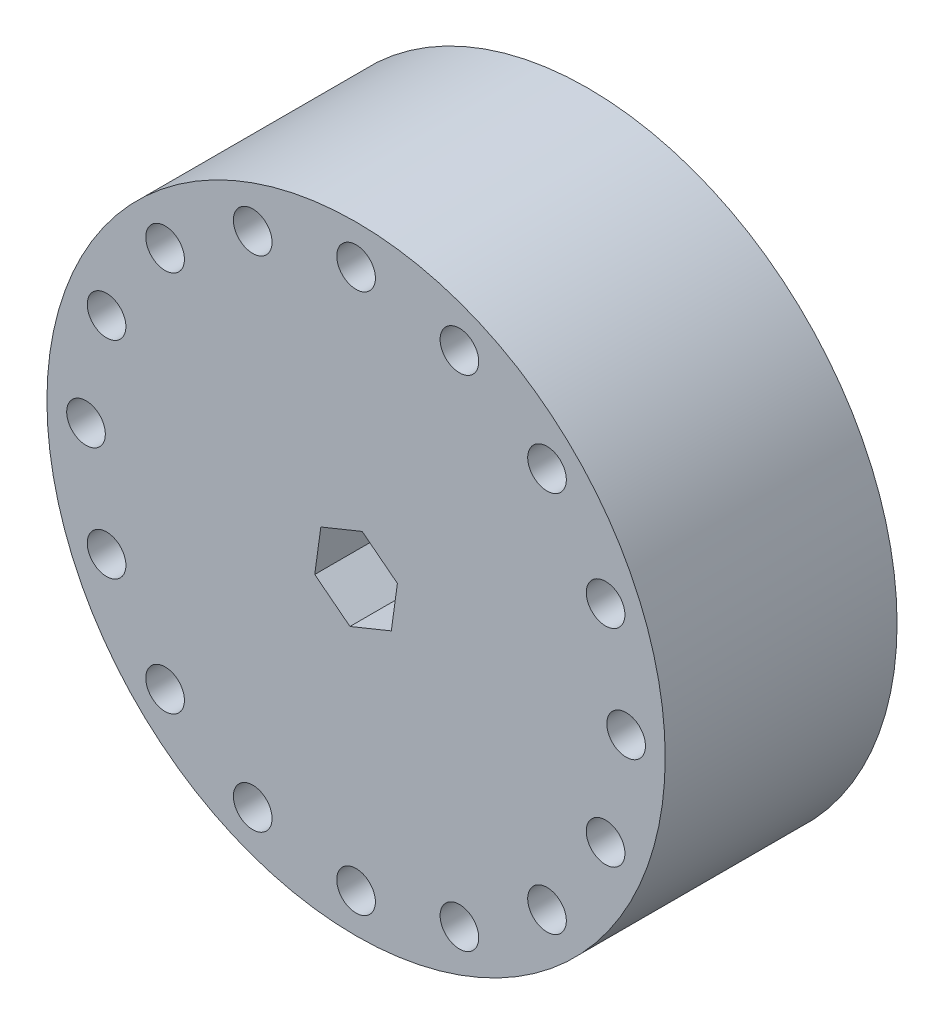
ISO-10303-21;
HEADER;
FILE_DESCRIPTION(('STEP AP214'),'2;1');
FILE_NAME('part.step','',(''),(''),'','','');
FILE_SCHEMA(('AUTOMOTIVE_DESIGN { 1 0 10303 214 1 1 1 1 }'));
ENDSEC;
DATA;
#1=APPLICATION_CONTEXT('core data for automotive mechanical design processes');
#2=APPLICATION_PROTOCOL_DEFINITION('international standard','automotive_design',2000,#1);
#3=PRODUCT_CONTEXT('',#1,'mechanical');
#4=PRODUCT('Part','Part','',(#3));
#5=PRODUCT_RELATED_PRODUCT_CATEGORY('part','',(#4));
#6=PRODUCT_DEFINITION_FORMATION('','',#4);
#7=PRODUCT_DEFINITION_CONTEXT('part definition',#1,'design');
#8=PRODUCT_DEFINITION('design','',#6,#7);
#9=PRODUCT_DEFINITION_SHAPE('','',#8);
#10=(LENGTH_UNIT() NAMED_UNIT(*) SI_UNIT(.MILLI.,.METRE.));
#11=(NAMED_UNIT(*) PLANE_ANGLE_UNIT() SI_UNIT($,.RADIAN.));
#12=(NAMED_UNIT(*) SI_UNIT($,.STERADIAN.) SOLID_ANGLE_UNIT());
#13=UNCERTAINTY_MEASURE_WITH_UNIT(LENGTH_MEASURE(1.E-05),#10,'distance_accuracy_value','');
#14=(GEOMETRIC_REPRESENTATION_CONTEXT(3) GLOBAL_UNCERTAINTY_ASSIGNED_CONTEXT((#13)) GLOBAL_UNIT_ASSIGNED_CONTEXT((#10,
#11,#12)) REPRESENTATION_CONTEXT('',''));
#15=CARTESIAN_POINT('',(0.,0.,0.));
#16=DIRECTION('',(0.,0.,1.));
#17=DIRECTION('',(1.,0.,0.));
#18=AXIS2_PLACEMENT_3D('',#15,#16,#17);
#19=CARTESIAN_POINT('',(0.,0.,38.1));
#20=DIRECTION('',(0.,0.,1.));
#21=DIRECTION('',(1.,0.,0.));
#22=AXIS2_PLACEMENT_3D('',#19,#20,#21);
#23=PLANE('',#22);
#24=CARTESIAN_POINT('',(-16.9823955575771,40.9991296766855,38.1));
#25=DIRECTION('',(0.,0.,1.));
#26=DIRECTION('',(1.,0.,0.));
#27=AXIS2_PLACEMENT_3D('',#24,#25,#26);
#28=CIRCLE('',#27,3.17500000000211);
#29=CARTESIAN_POINT('',(-13.807395557575,40.9991296766855,38.1));
#30=VERTEX_POINT('',#29);
#31=EDGE_CURVE('E380',#30,#30,#28,.T.);
#32=ORIENTED_EDGE('',*,*,#31,.F.);
#33=EDGE_LOOP('',(#32));
#34=FACE_BOUND('',#33,.T.);
#35=CARTESIAN_POINT('',(-31.3793753373108,31.3793753373074,38.1));
#36=DIRECTION('',(0.,0.,1.));
#37=DIRECTION('',(1.,0.,0.));
#38=AXIS2_PLACEMENT_3D('',#35,#36,#37);
#39=CIRCLE('',#38,3.17500000000451);
#40=CARTESIAN_POINT('',(-28.2043753373063,31.3793753373074,38.1));
#41=VERTEX_POINT('',#40);
#42=EDGE_CURVE('E382',#41,#41,#39,.T.);
#43=ORIENTED_EDGE('',*,*,#42,.F.);
#44=EDGE_LOOP('',(#43));
#45=FACE_BOUND('',#44,.T.);
#46=CARTESIAN_POINT('',(-40.9991296766835,16.9823955575701,38.1));
#47=DIRECTION('',(0.,0.,1.));
#48=DIRECTION('',(1.,0.,0.));
#49=AXIS2_PLACEMENT_3D('',#46,#47,#48);
#50=CIRCLE('',#49,3.1750000000075);
#51=CARTESIAN_POINT('',(-37.824129676676,16.9823955575701,38.1));
#52=VERTEX_POINT('',#51);
#53=EDGE_CURVE('E388',#52,#52,#50,.T.);
#54=ORIENTED_EDGE('',*,*,#53,.F.);
#55=EDGE_LOOP('',(#54));
#56=FACE_BOUND('',#55,.T.);
#57=CARTESIAN_POINT('',(-44.377138180816,-8.19828182373377E-12,38.1));
#58=DIRECTION('',(0.,0.,1.));
#59=DIRECTION('',(1.,0.,0.));
#60=AXIS2_PLACEMENT_3D('',#57,#58,#59);
#61=CIRCLE('',#60,3.17500000001068);
#62=CARTESIAN_POINT('',(-41.2021381808053,-8.19828182373377E-12,38.1));
#63=VERTEX_POINT('',#62);
#64=EDGE_CURVE('E394',#63,#63,#61,.T.);
#65=ORIENTED_EDGE('',*,*,#64,.F.);
#66=EDGE_LOOP('',(#65));
#67=FACE_BOUND('',#66,.T.);
#68=CARTESIAN_POINT('',(-40.9991296766773,-16.9823955575853,38.1));
#69=DIRECTION('',(0.,0.,1.));
#70=DIRECTION('',(1.,0.,0.));
#71=AXIS2_PLACEMENT_3D('',#68,#69,#70);
#72=CIRCLE('',#71,3.1750000000135);
#73=CARTESIAN_POINT('',(-37.8241296766638,-16.9823955575853,38.1));
#74=VERTEX_POINT('',#73);
#75=EDGE_CURVE('E400',#74,#74,#72,.T.);
#76=ORIENTED_EDGE('',*,*,#75,.F.);
#77=EDGE_LOOP('',(#76));
#78=FACE_BOUND('',#77,.T.);
#79=CARTESIAN_POINT('',(-31.3793753372992,-31.379375337319,38.1));
#80=DIRECTION('',(0.,0.,1.));
#81=DIRECTION('',(1.,0.,0.));
#82=AXIS2_PLACEMENT_3D('',#79,#80,#81);
#83=CIRCLE('',#82,3.17500000001545);
#84=CARTESIAN_POINT('',(-28.2043753372838,-31.379375337319,38.1));
#85=VERTEX_POINT('',#84);
#86=EDGE_CURVE('E406',#85,#85,#83,.T.);
#87=ORIENTED_EDGE('',*,*,#86,.F.);
#88=EDGE_LOOP('',(#87));
#89=FACE_BOUND('',#88,.T.);
#90=CARTESIAN_POINT('',(-16.9823955575619,-40.9991296766917,38.1));
#91=DIRECTION('',(0.,0.,1.));
#92=DIRECTION('',(1.,0.,0.));
#93=AXIS2_PLACEMENT_3D('',#90,#91,#92);
#94=CIRCLE('',#93,3.17500000001632);
#95=CARTESIAN_POINT('',(-13.8073955575456,-40.9991296766917,38.1));
#96=VERTEX_POINT('',#95);
#97=EDGE_CURVE('E412',#96,#96,#94,.T.);
#98=ORIENTED_EDGE('',*,*,#97,.F.);
#99=EDGE_LOOP('',(#98));
#100=FACE_BOUND('',#99,.T.);
#101=CARTESIAN_POINT('',(1.63856943834218E-11,-44.3771381808242,38.1));
#102=DIRECTION('',(0.,0.,1.));
#103=DIRECTION('',(1.,0.,0.));
#104=AXIS2_PLACEMENT_3D('',#101,#102,#103);
#105=CIRCLE('',#104,3.17500000001597);
#106=CARTESIAN_POINT('',(3.17500000003235,-44.3771381808242,38.1));
#107=VERTEX_POINT('',#106);
#108=EDGE_CURVE('E418',#107,#107,#105,.T.);
#109=ORIENTED_EDGE('',*,*,#108,.F.);
#110=EDGE_LOOP('',(#109));
#111=FACE_BOUND('',#110,.T.);
#112=CARTESIAN_POINT('',(16.9823955575934,-40.9991296766855,38.1));
#113=DIRECTION('',(0.,0.,1.));
#114=DIRECTION('',(1.,0.,0.));
#115=AXIS2_PLACEMENT_3D('',#112,#113,#114);
#116=CIRCLE('',#115,3.17500000001442);
#117=CARTESIAN_POINT('',(20.1573955576078,-40.9991296766855,38.1));
#118=VERTEX_POINT('',#117);
#119=EDGE_CURVE('E424',#118,#118,#116,.T.);
#120=ORIENTED_EDGE('',*,*,#119,.F.);
#121=EDGE_LOOP('',(#120));
#122=FACE_BOUND('',#121,.T.);
#123=CARTESIAN_POINT('',(31.3793753373272,-31.3793753373074,38.1));
#124=DIRECTION('',(0.,0.,1.));
#125=DIRECTION('',(1.,0.,0.));
#126=AXIS2_PLACEMENT_3D('',#123,#124,#125);
#127=CIRCLE('',#126,3.1750000000119);
#128=CARTESIAN_POINT('',(34.5543753373391,-31.3793753373074,38.1));
#129=VERTEX_POINT('',#128);
#130=EDGE_CURVE('E430',#129,#129,#127,.T.);
#131=ORIENTED_EDGE('',*,*,#130,.F.);
#132=EDGE_LOOP('',(#131));
#133=FACE_BOUND('',#132,.T.);
#134=CARTESIAN_POINT('',(40.9991296766999,-16.9823955575701,38.1));
#135=DIRECTION('',(0.,0.,1.));
#136=DIRECTION('',(1.,0.,0.));
#137=AXIS2_PLACEMENT_3D('',#134,#135,#136);
#138=CIRCLE('',#137,3.17500000000881);
#139=CARTESIAN_POINT('',(44.1741296767087,-16.9823955575701,38.1));
#140=VERTEX_POINT('',#139);
#141=EDGE_CURVE('E436',#140,#140,#138,.T.);
#142=ORIENTED_EDGE('',*,*,#141,.F.);
#143=EDGE_LOOP('',(#142));
#144=FACE_BOUND('',#143,.T.);
#145=CARTESIAN_POINT('',(44.3771381808323,8.19284719171092E-12,38.1));
#146=DIRECTION('',(0.,0.,1.));
#147=DIRECTION('',(1.,0.,0.));
#148=AXIS2_PLACEMENT_3D('',#145,#146,#147);
#149=CIRCLE('',#148,3.17500000000559);
#150=CARTESIAN_POINT('',(47.5521381808379,8.19284719171092E-12,38.1));
#151=VERTEX_POINT('',#150);
#152=EDGE_CURVE('E442',#151,#151,#149,.T.);
#153=ORIENTED_EDGE('',*,*,#152,.F.);
#154=EDGE_LOOP('',(#153));
#155=FACE_BOUND('',#154,.T.);
#156=CARTESIAN_POINT('',(40.9991296766937,16.9823955575852,38.1));
#157=DIRECTION('',(0.,0.,1.));
#158=DIRECTION('',(1.,0.,0.));
#159=AXIS2_PLACEMENT_3D('',#156,#157,#158);
#160=CIRCLE('',#159,3.17500000000274);
#161=CARTESIAN_POINT('',(44.1741296766964,16.9823955575852,38.1));
#162=VERTEX_POINT('',#161);
#163=EDGE_CURVE('E448',#162,#162,#160,.T.);
#164=ORIENTED_EDGE('',*,*,#163,.F.);
#165=EDGE_LOOP('',(#164));
#166=FACE_BOUND('',#165,.T.);
#167=CARTESIAN_POINT('',(31.3793753373156,31.379375337319,38.1));
#168=DIRECTION('',(0.,0.,1.));
#169=DIRECTION('',(1.,0.,0.));
#170=AXIS2_PLACEMENT_3D('',#167,#168,#169);
#171=CIRCLE('',#170,3.17500000000068);
#172=CARTESIAN_POINT('',(34.5543753373163,31.379375337319,38.1));
#173=VERTEX_POINT('',#172);
#174=EDGE_CURVE('E454',#173,#173,#171,.T.);
#175=ORIENTED_EDGE('',*,*,#174,.F.);
#176=EDGE_LOOP('',(#175));
#177=FACE_BOUND('',#176,.T.);
#178=CARTESIAN_POINT('',(16.9823955575783,40.9991296766917,38.1));
#179=DIRECTION('',(0.,0.,1.));
#180=DIRECTION('',(1.,0.,0.));
#181=AXIS2_PLACEMENT_3D('',#178,#179,#180);
#182=CIRCLE('',#181,3.17499999999974);
#183=CARTESIAN_POINT('',(20.157395557578,40.9991296766917,38.1));
#184=VERTEX_POINT('',#183);
#185=EDGE_CURVE('E460',#184,#184,#182,.T.);
#186=ORIENTED_EDGE('',*,*,#185,.F.);
#187=EDGE_LOOP('',(#186));
#188=FACE_BOUND('',#187,.T.);
#189=CARTESIAN_POINT('',(0.,44.3771381808242,38.1));
#190=DIRECTION('',(0.,0.,1.));
#191=DIRECTION('',(1.,0.,0.));
#192=AXIS2_PLACEMENT_3D('',#189,#190,#191);
#193=CIRCLE('',#192,3.175);
#194=CARTESIAN_POINT('',(3.175,44.3771381808242,38.1));
#195=VERTEX_POINT('',#194);
#196=EDGE_CURVE('E466',#195,#195,#193,.T.);
#197=ORIENTED_EDGE('',*,*,#196,.F.);
#198=EDGE_LOOP('',(#197));
#199=FACE_BOUND('',#198,.T.);
#200=CARTESIAN_POINT('',(0.,0.,38.1));
#201=DIRECTION('',(0.,0.,1.));
#202=DIRECTION('',(1.,0.,0.));
#203=AXIS2_PLACEMENT_3D('',#200,#201,#202);
#204=CIRCLE('',#203,50.8);
#205=CARTESIAN_POINT('',(50.8,0.,38.1));
#206=VERTEX_POINT('',#205);
#207=EDGE_CURVE('E11',#206,#206,#204,.T.);
#208=ORIENTED_EDGE('',*,*,#207,.T.);
#209=EDGE_LOOP('',(#208));
#210=FACE_BOUND('',#209,.T.);
#211=DIRECTION('',(0.136672466022037,0.99061629152334,0.));
#212=VECTOR('',#211,1.);
#213=CARTESIAN_POINT('',(5.7893483811144,-4.49964205858883,38.1));
#214=LINE('',#213,#212);
#215=CARTESIAN_POINT('',(5.7893483811144,-4.49964205858883,38.1));
#216=VERTEX_POINT('',#215);
#217=CARTESIAN_POINT('',(6.79147852123204,2.76390174010897,38.1));
#218=VERTEX_POINT('',#217);
#219=EDGE_CURVE('E94',#216,#218,#214,.T.);
#220=ORIENTED_EDGE('',*,*,#219,.F.);
#221=DIRECTION('',(0.926235106872962,0.376946318188721,0.));
#222=VECTOR('',#221,1.);
#223=CARTESIAN_POINT('',(-1.00213014011763,-7.26354379869779,38.1));
#224=LINE('',#223,#222);
#225=CARTESIAN_POINT('',(-1.00213014011763,-7.26354379869779,38.1));
#226=VERTEX_POINT('',#225);
#227=EDGE_CURVE('E86',#226,#216,#224,.T.);
#228=ORIENTED_EDGE('',*,*,#227,.F.);
#229=DIRECTION('',(0.789562640850925,-0.61366997333462,0.));
#230=VECTOR('',#229,1.);
#231=CARTESIAN_POINT('',(-6.79147852123202,-2.76390174010896,38.1));
#232=LINE('',#231,#230);
#233=CARTESIAN_POINT('',(-6.79147852123202,-2.76390174010896,38.1));
#234=VERTEX_POINT('',#233);
#235=EDGE_CURVE('E115',#234,#226,#232,.T.);
#236=ORIENTED_EDGE('',*,*,#235,.F.);
#237=DIRECTION('',(-0.136672466022037,-0.99061629152334,0.));
#238=VECTOR('',#237,1.);
#239=CARTESIAN_POINT('',(-5.78934838111438,4.49964205858884,38.1));
#240=LINE('',#239,#238);
#241=CARTESIAN_POINT('',(-5.78934838111438,4.49964205858884,38.1));
#242=VERTEX_POINT('',#241);
#243=EDGE_CURVE('E113',#242,#234,#240,.T.);
#244=ORIENTED_EDGE('',*,*,#243,.F.);
#245=DIRECTION('',(-0.926235106872962,-0.37694631818872,0.));
#246=VECTOR('',#245,1.);
#247=CARTESIAN_POINT('',(1.00213014011765,7.2635437986978,38.1));
#248=LINE('',#247,#246);
#249=CARTESIAN_POINT('',(1.00213014011765,7.2635437986978,38.1));
#250=VERTEX_POINT('',#249);
#251=EDGE_CURVE('E108',#250,#242,#248,.T.);
#252=ORIENTED_EDGE('',*,*,#251,.F.);
#253=DIRECTION('',(-0.789562640850925,0.61366997333462,0.));
#254=VECTOR('',#253,1.);
#255=CARTESIAN_POINT('',(6.79147852123204,2.76390174010897,38.1));
#256=LINE('',#255,#254);
#257=EDGE_CURVE('E106',#218,#250,#256,.T.);
#258=ORIENTED_EDGE('',*,*,#257,.F.);
#259=EDGE_LOOP('',(#220,#228,#236,#244,#252,#258));
#260=FACE_BOUND('',#259,.T.);
#261=ADVANCED_FACE('F33',(#34,#45,#56,#67,#78,#89,#100,#111,#122,#133,#144,#155,#166,#177,#188,
#199,#210,#260),#23,.T.);
#262=CARTESIAN_POINT('',(0.,0.,0.));
#263=DIRECTION('',(0.,0.,1.));
#264=DIRECTION('',(1.,0.,0.));
#265=AXIS2_PLACEMENT_3D('',#262,#263,#264);
#266=PLANE('',#265);
#267=CARTESIAN_POINT('',(-16.9823955575771,40.9991296766855,0.));
#268=DIRECTION('',(0.,0.,1.));
#269=DIRECTION('',(1.,0.,0.));
#270=AXIS2_PLACEMENT_3D('',#267,#268,#269);
#271=CIRCLE('',#270,3.17500000000211);
#272=CARTESIAN_POINT('',(-13.807395557575,40.9991296766855,0.));
#273=VERTEX_POINT('',#272);
#274=EDGE_CURVE('E378',#273,#273,#271,.T.);
#275=ORIENTED_EDGE('',*,*,#274,.T.);
#276=EDGE_LOOP('',(#275));
#277=FACE_BOUND('',#276,.T.);
#278=CARTESIAN_POINT('',(-31.3793753373108,31.3793753373074,0.));
#279=DIRECTION('',(0.,0.,1.));
#280=DIRECTION('',(1.,0.,0.));
#281=AXIS2_PLACEMENT_3D('',#278,#279,#280);
#282=CIRCLE('',#281,3.17500000000451);
#283=CARTESIAN_POINT('',(-28.2043753373063,31.3793753373074,0.));
#284=VERTEX_POINT('',#283);
#285=EDGE_CURVE('E385',#284,#284,#282,.T.);
#286=ORIENTED_EDGE('',*,*,#285,.T.);
#287=EDGE_LOOP('',(#286));
#288=FACE_BOUND('',#287,.T.);
#289=CARTESIAN_POINT('',(-40.9991296766835,16.9823955575701,0.));
#290=DIRECTION('',(0.,0.,1.));
#291=DIRECTION('',(1.,0.,0.));
#292=AXIS2_PLACEMENT_3D('',#289,#290,#291);
#293=CIRCLE('',#292,3.1750000000075);
#294=CARTESIAN_POINT('',(-37.824129676676,16.9823955575701,0.));
#295=VERTEX_POINT('',#294);
#296=EDGE_CURVE('E391',#295,#295,#293,.T.);
#297=ORIENTED_EDGE('',*,*,#296,.T.);
#298=EDGE_LOOP('',(#297));
#299=FACE_BOUND('',#298,.T.);
#300=CARTESIAN_POINT('',(-44.377138180816,-8.19828182373377E-12,0.));
#301=DIRECTION('',(0.,0.,1.));
#302=DIRECTION('',(1.,0.,0.));
#303=AXIS2_PLACEMENT_3D('',#300,#301,#302);
#304=CIRCLE('',#303,3.17500000001068);
#305=CARTESIAN_POINT('',(-41.2021381808053,-8.19828182373377E-12,0.));
#306=VERTEX_POINT('',#305);
#307=EDGE_CURVE('E397',#306,#306,#304,.T.);
#308=ORIENTED_EDGE('',*,*,#307,.T.);
#309=EDGE_LOOP('',(#308));
#310=FACE_BOUND('',#309,.T.);
#311=CARTESIAN_POINT('',(-40.9991296766773,-16.9823955575853,0.));
#312=DIRECTION('',(0.,0.,1.));
#313=DIRECTION('',(1.,0.,0.));
#314=AXIS2_PLACEMENT_3D('',#311,#312,#313);
#315=CIRCLE('',#314,3.1750000000135);
#316=CARTESIAN_POINT('',(-37.8241296766638,-16.9823955575853,0.));
#317=VERTEX_POINT('',#316);
#318=EDGE_CURVE('E403',#317,#317,#315,.T.);
#319=ORIENTED_EDGE('',*,*,#318,.T.);
#320=EDGE_LOOP('',(#319));
#321=FACE_BOUND('',#320,.T.);
#322=CARTESIAN_POINT('',(-31.3793753372992,-31.379375337319,0.));
#323=DIRECTION('',(0.,0.,1.));
#324=DIRECTION('',(1.,0.,0.));
#325=AXIS2_PLACEMENT_3D('',#322,#323,#324);
#326=CIRCLE('',#325,3.17500000001545);
#327=CARTESIAN_POINT('',(-28.2043753372838,-31.379375337319,0.));
#328=VERTEX_POINT('',#327);
#329=EDGE_CURVE('E409',#328,#328,#326,.T.);
#330=ORIENTED_EDGE('',*,*,#329,.T.);
#331=EDGE_LOOP('',(#330));
#332=FACE_BOUND('',#331,.T.);
#333=CARTESIAN_POINT('',(-16.9823955575619,-40.9991296766917,0.));
#334=DIRECTION('',(0.,0.,1.));
#335=DIRECTION('',(1.,0.,0.));
#336=AXIS2_PLACEMENT_3D('',#333,#334,#335);
#337=CIRCLE('',#336,3.17500000001632);
#338=CARTESIAN_POINT('',(-13.8073955575456,-40.9991296766917,0.));
#339=VERTEX_POINT('',#338);
#340=EDGE_CURVE('E415',#339,#339,#337,.T.);
#341=ORIENTED_EDGE('',*,*,#340,.T.);
#342=EDGE_LOOP('',(#341));
#343=FACE_BOUND('',#342,.T.);
#344=CARTESIAN_POINT('',(1.63856943834218E-11,-44.3771381808242,0.));
#345=DIRECTION('',(0.,0.,1.));
#346=DIRECTION('',(1.,0.,0.));
#347=AXIS2_PLACEMENT_3D('',#344,#345,#346);
#348=CIRCLE('',#347,3.17500000001597);
#349=CARTESIAN_POINT('',(3.17500000003235,-44.3771381808242,0.));
#350=VERTEX_POINT('',#349);
#351=EDGE_CURVE('E421',#350,#350,#348,.T.);
#352=ORIENTED_EDGE('',*,*,#351,.T.);
#353=EDGE_LOOP('',(#352));
#354=FACE_BOUND('',#353,.T.);
#355=CARTESIAN_POINT('',(16.9823955575934,-40.9991296766855,0.));
#356=DIRECTION('',(0.,0.,1.));
#357=DIRECTION('',(1.,0.,0.));
#358=AXIS2_PLACEMENT_3D('',#355,#356,#357);
#359=CIRCLE('',#358,3.17500000001442);
#360=CARTESIAN_POINT('',(20.1573955576078,-40.9991296766855,0.));
#361=VERTEX_POINT('',#360);
#362=EDGE_CURVE('E427',#361,#361,#359,.T.);
#363=ORIENTED_EDGE('',*,*,#362,.T.);
#364=EDGE_LOOP('',(#363));
#365=FACE_BOUND('',#364,.T.);
#366=CARTESIAN_POINT('',(31.3793753373272,-31.3793753373074,0.));
#367=DIRECTION('',(0.,0.,1.));
#368=DIRECTION('',(1.,0.,0.));
#369=AXIS2_PLACEMENT_3D('',#366,#367,#368);
#370=CIRCLE('',#369,3.1750000000119);
#371=CARTESIAN_POINT('',(34.5543753373391,-31.3793753373074,0.));
#372=VERTEX_POINT('',#371);
#373=EDGE_CURVE('E433',#372,#372,#370,.T.);
#374=ORIENTED_EDGE('',*,*,#373,.T.);
#375=EDGE_LOOP('',(#374));
#376=FACE_BOUND('',#375,.T.);
#377=CARTESIAN_POINT('',(40.9991296766999,-16.9823955575701,0.));
#378=DIRECTION('',(0.,0.,1.));
#379=DIRECTION('',(1.,0.,0.));
#380=AXIS2_PLACEMENT_3D('',#377,#378,#379);
#381=CIRCLE('',#380,3.17500000000881);
#382=CARTESIAN_POINT('',(44.1741296767087,-16.9823955575701,0.));
#383=VERTEX_POINT('',#382);
#384=EDGE_CURVE('E439',#383,#383,#381,.T.);
#385=ORIENTED_EDGE('',*,*,#384,.T.);
#386=EDGE_LOOP('',(#385));
#387=FACE_BOUND('',#386,.T.);
#388=CARTESIAN_POINT('',(44.3771381808323,8.19284719171092E-12,0.));
#389=DIRECTION('',(0.,0.,1.));
#390=DIRECTION('',(1.,0.,0.));
#391=AXIS2_PLACEMENT_3D('',#388,#389,#390);
#392=CIRCLE('',#391,3.17500000000559);
#393=CARTESIAN_POINT('',(47.5521381808379,8.19284719171092E-12,0.));
#394=VERTEX_POINT('',#393);
#395=EDGE_CURVE('E445',#394,#394,#392,.T.);
#396=ORIENTED_EDGE('',*,*,#395,.T.);
#397=EDGE_LOOP('',(#396));
#398=FACE_BOUND('',#397,.T.);
#399=CARTESIAN_POINT('',(40.9991296766937,16.9823955575852,0.));
#400=DIRECTION('',(0.,0.,1.));
#401=DIRECTION('',(1.,0.,0.));
#402=AXIS2_PLACEMENT_3D('',#399,#400,#401);
#403=CIRCLE('',#402,3.17500000000274);
#404=CARTESIAN_POINT('',(44.1741296766964,16.9823955575852,0.));
#405=VERTEX_POINT('',#404);
#406=EDGE_CURVE('E451',#405,#405,#403,.T.);
#407=ORIENTED_EDGE('',*,*,#406,.T.);
#408=EDGE_LOOP('',(#407));
#409=FACE_BOUND('',#408,.T.);
#410=CARTESIAN_POINT('',(31.3793753373156,31.379375337319,0.));
#411=DIRECTION('',(0.,0.,1.));
#412=DIRECTION('',(1.,0.,0.));
#413=AXIS2_PLACEMENT_3D('',#410,#411,#412);
#414=CIRCLE('',#413,3.17500000000068);
#415=CARTESIAN_POINT('',(34.5543753373163,31.379375337319,0.));
#416=VERTEX_POINT('',#415);
#417=EDGE_CURVE('E457',#416,#416,#414,.T.);
#418=ORIENTED_EDGE('',*,*,#417,.T.);
#419=EDGE_LOOP('',(#418));
#420=FACE_BOUND('',#419,.T.);
#421=CARTESIAN_POINT('',(16.9823955575783,40.9991296766917,0.));
#422=DIRECTION('',(0.,0.,1.));
#423=DIRECTION('',(1.,0.,0.));
#424=AXIS2_PLACEMENT_3D('',#421,#422,#423);
#425=CIRCLE('',#424,3.17499999999974);
#426=CARTESIAN_POINT('',(20.157395557578,40.9991296766917,0.));
#427=VERTEX_POINT('',#426);
#428=EDGE_CURVE('E463',#427,#427,#425,.T.);
#429=ORIENTED_EDGE('',*,*,#428,.T.);
#430=EDGE_LOOP('',(#429));
#431=FACE_BOUND('',#430,.T.);
#432=CARTESIAN_POINT('',(0.,44.3771381808242,0.));
#433=DIRECTION('',(0.,0.,1.));
#434=DIRECTION('',(1.,0.,0.));
#435=AXIS2_PLACEMENT_3D('',#432,#433,#434);
#436=CIRCLE('',#435,3.175);
#437=CARTESIAN_POINT('',(3.175,44.3771381808242,0.));
#438=VERTEX_POINT('',#437);
#439=EDGE_CURVE('E118',#438,#438,#436,.T.);
#440=ORIENTED_EDGE('',*,*,#439,.T.);
#441=EDGE_LOOP('',(#440));
#442=FACE_BOUND('',#441,.T.);
#443=CARTESIAN_POINT('',(0.,0.,0.));
#444=DIRECTION('',(0.,0.,1.));
#445=DIRECTION('',(1.,0.,0.));
#446=AXIS2_PLACEMENT_3D('',#443,#444,#445);
#447=CIRCLE('',#446,50.8);
#448=CARTESIAN_POINT('',(50.8,0.,0.));
#449=VERTEX_POINT('',#448);
#450=EDGE_CURVE('E37',#449,#449,#447,.T.);
#451=ORIENTED_EDGE('',*,*,#450,.F.);
#452=EDGE_LOOP('',(#451));
#453=FACE_BOUND('',#452,.T.);
#454=DIRECTION('',(0.926235106872962,0.376946318188721,0.));
#455=VECTOR('',#454,1.);
#456=CARTESIAN_POINT('',(-1.00213014011763,-7.26354379869779,0.));
#457=LINE('',#456,#455);
#458=CARTESIAN_POINT('',(-1.00213014011763,-7.26354379869779,0.));
#459=VERTEX_POINT('',#458);
#460=CARTESIAN_POINT('',(5.7893483811144,-4.49964205858883,0.));
#461=VERTEX_POINT('',#460);
#462=EDGE_CURVE('E56',#459,#461,#457,.T.);
#463=ORIENTED_EDGE('',*,*,#462,.T.);
#464=DIRECTION('',(0.136672466022037,0.99061629152334,0.));
#465=VECTOR('',#464,1.);
#466=CARTESIAN_POINT('',(5.7893483811144,-4.49964205858883,0.));
#467=LINE('',#466,#465);
#468=CARTESIAN_POINT('',(6.79147852123204,2.76390174010897,0.));
#469=VERTEX_POINT('',#468);
#470=EDGE_CURVE('E101',#461,#469,#467,.T.);
#471=ORIENTED_EDGE('',*,*,#470,.T.);
#472=DIRECTION('',(-0.789562640850925,0.61366997333462,0.));
#473=VECTOR('',#472,1.);
#474=CARTESIAN_POINT('',(6.79147852123204,2.76390174010897,0.));
#475=LINE('',#474,#473);
#476=CARTESIAN_POINT('',(1.00213014011765,7.2635437986978,0.));
#477=VERTEX_POINT('',#476);
#478=EDGE_CURVE('E120',#469,#477,#475,.T.);
#479=ORIENTED_EDGE('',*,*,#478,.T.);
#480=DIRECTION('',(-0.926235106872962,-0.37694631818872,0.));
#481=VECTOR('',#480,1.);
#482=CARTESIAN_POINT('',(1.00213014011765,7.2635437986978,0.));
#483=LINE('',#482,#481);
#484=CARTESIAN_POINT('',(-5.78934838111438,4.49964205858884,0.));
#485=VERTEX_POINT('',#484);
#486=EDGE_CURVE('E123',#477,#485,#483,.T.);
#487=ORIENTED_EDGE('',*,*,#486,.T.);
#488=DIRECTION('',(-0.136672466022037,-0.99061629152334,0.));
#489=VECTOR('',#488,1.);
#490=CARTESIAN_POINT('',(-5.78934838111438,4.49964205858884,0.));
#491=LINE('',#490,#489);
#492=CARTESIAN_POINT('',(-6.79147852123202,-2.76390174010896,0.));
#493=VERTEX_POINT('',#492);
#494=EDGE_CURVE('E126',#485,#493,#491,.T.);
#495=ORIENTED_EDGE('',*,*,#494,.T.);
#496=DIRECTION('',(0.789562640850925,-0.61366997333462,0.));
#497=VECTOR('',#496,1.);
#498=CARTESIAN_POINT('',(-6.79147852123202,-2.76390174010896,0.));
#499=LINE('',#498,#497);
#500=EDGE_CURVE('E95',#493,#459,#499,.T.);
#501=ORIENTED_EDGE('',*,*,#500,.T.);
#502=EDGE_LOOP('',(#463,#471,#479,#487,#495,#501));
#503=FACE_BOUND('',#502,.T.);
#504=ADVANCED_FACE('F143',(#277,#288,#299,#310,#321,#332,#343,#354,#365,#376,#387,#398,#409,
#420,#431,#442,#453,#503),#266,.F.);
#505=CARTESIAN_POINT('',(0.,0.,38.1));
#506=DIRECTION('',(0.,0.,-1.));
#507=DIRECTION('',(-1.,0.,0.));
#508=AXIS2_PLACEMENT_3D('',#505,#506,#507);
#509=CYLINDRICAL_SURFACE('',#508,50.8);
#510=ORIENTED_EDGE('',*,*,#207,.F.);
#511=EDGE_LOOP('',(#510));
#512=FACE_BOUND('',#511,.T.);
#513=ORIENTED_EDGE('',*,*,#450,.T.);
#514=EDGE_LOOP('',(#513));
#515=FACE_BOUND('',#514,.T.);
#516=ADVANCED_FACE('F35',(#512,#515),#509,.T.);
#517=CARTESIAN_POINT('',(-1.00213014011763,-7.26354379869779,38.1));
#518=DIRECTION('',(-0.376946318188721,0.926235106872962,0.));
#519=DIRECTION('',(-0.926235106872962,-0.376946318188721,0.));
#520=AXIS2_PLACEMENT_3D('',#517,#518,#519);
#521=PLANE('',#520);
#522=ORIENTED_EDGE('',*,*,#462,.F.);
#523=DIRECTION('',(0.,0.,-1.));
#524=VECTOR('',#523,1.);
#525=CARTESIAN_POINT('',(-1.00213014011763,-7.26354379869779,38.1));
#526=LINE('',#525,#524);
#527=EDGE_CURVE('E90',#226,#459,#526,.T.);
#528=ORIENTED_EDGE('',*,*,#527,.F.);
#529=ORIENTED_EDGE('',*,*,#227,.T.);
#530=DIRECTION('',(0.,0.,-1.));
#531=VECTOR('',#530,1.);
#532=CARTESIAN_POINT('',(5.7893483811144,-4.49964205858883,38.1));
#533=LINE('',#532,#531);
#534=EDGE_CURVE('E89',#216,#461,#533,.T.);
#535=ORIENTED_EDGE('',*,*,#534,.T.);
#536=EDGE_LOOP('',(#522,#528,#529,#535));
#537=FACE_BOUND('',#536,.T.);
#538=ADVANCED_FACE('F88',(#537),#521,.T.);
#539=CARTESIAN_POINT('',(5.7893483811144,-4.49964205858883,38.1));
#540=DIRECTION('',(-0.99061629152334,0.136672466022037,0.));
#541=DIRECTION('',(-0.136672466022037,-0.99061629152334,0.));
#542=AXIS2_PLACEMENT_3D('',#539,#540,#541);
#543=PLANE('',#542);
#544=ORIENTED_EDGE('',*,*,#470,.F.);
#545=ORIENTED_EDGE('',*,*,#534,.F.);
#546=ORIENTED_EDGE('',*,*,#219,.T.);
#547=DIRECTION('',(0.,0.,-1.));
#548=VECTOR('',#547,1.);
#549=CARTESIAN_POINT('',(6.79147852123204,2.76390174010897,38.1));
#550=LINE('',#549,#548);
#551=EDGE_CURVE('E102',#218,#469,#550,.T.);
#552=ORIENTED_EDGE('',*,*,#551,.T.);
#553=EDGE_LOOP('',(#544,#545,#546,#552));
#554=FACE_BOUND('',#553,.T.);
#555=ADVANCED_FACE('F98',(#554),#543,.T.);
#556=CARTESIAN_POINT('',(6.79147852123204,2.76390174010897,38.1));
#557=DIRECTION('',(-0.61366997333462,-0.789562640850925,0.));
#558=DIRECTION('',(0.789562640850925,-0.61366997333462,0.));
#559=AXIS2_PLACEMENT_3D('',#556,#557,#558);
#560=PLANE('',#559);
#561=ORIENTED_EDGE('',*,*,#478,.F.);
#562=ORIENTED_EDGE('',*,*,#551,.F.);
#563=ORIENTED_EDGE('',*,*,#257,.T.);
#564=DIRECTION('',(0.,0.,-1.));
#565=VECTOR('',#564,1.);
#566=CARTESIAN_POINT('',(1.00213014011765,7.2635437986978,38.1));
#567=LINE('',#566,#565);
#568=EDGE_CURVE('E135',#250,#477,#567,.T.);
#569=ORIENTED_EDGE('',*,*,#568,.T.);
#570=EDGE_LOOP('',(#561,#562,#563,#569));
#571=FACE_BOUND('',#570,.T.);
#572=ADVANCED_FACE('F139',(#571),#560,.T.);
#573=CARTESIAN_POINT('',(1.00213014011765,7.2635437986978,38.1));
#574=DIRECTION('',(0.37694631818872,-0.926235106872963,0.));
#575=DIRECTION('',(0.926235106872963,0.37694631818872,0.));
#576=AXIS2_PLACEMENT_3D('',#573,#574,#575);
#577=PLANE('',#576);
#578=ORIENTED_EDGE('',*,*,#486,.F.);
#579=ORIENTED_EDGE('',*,*,#568,.F.);
#580=ORIENTED_EDGE('',*,*,#251,.T.);
#581=DIRECTION('',(0.,0.,-1.));
#582=VECTOR('',#581,1.);
#583=CARTESIAN_POINT('',(-5.78934838111438,4.49964205858884,38.1));
#584=LINE('',#583,#582);
#585=EDGE_CURVE('E133',#242,#485,#584,.T.);
#586=ORIENTED_EDGE('',*,*,#585,.T.);
#587=EDGE_LOOP('',(#578,#579,#580,#586));
#588=FACE_BOUND('',#587,.T.);
#589=ADVANCED_FACE('F151',(#588),#577,.T.);
#590=CARTESIAN_POINT('',(-5.78934838111438,4.49964205858884,38.1));
#591=DIRECTION('',(0.99061629152334,-0.136672466022037,0.));
#592=DIRECTION('',(0.136672466022037,0.99061629152334,0.));
#593=AXIS2_PLACEMENT_3D('',#590,#591,#592);
#594=PLANE('',#593);
#595=ORIENTED_EDGE('',*,*,#494,.F.);
#596=ORIENTED_EDGE('',*,*,#585,.F.);
#597=ORIENTED_EDGE('',*,*,#243,.T.);
#598=DIRECTION('',(0.,0.,-1.));
#599=VECTOR('',#598,1.);
#600=CARTESIAN_POINT('',(-6.79147852123202,-2.76390174010896,38.1));
#601=LINE('',#600,#599);
#602=EDGE_CURVE('E48',#234,#493,#601,.T.);
#603=ORIENTED_EDGE('',*,*,#602,.T.);
#604=EDGE_LOOP('',(#595,#596,#597,#603));
#605=FACE_BOUND('',#604,.T.);
#606=ADVANCED_FACE('F149',(#605),#594,.T.);
#607=CARTESIAN_POINT('',(-6.79147852123202,-2.76390174010896,38.1));
#608=DIRECTION('',(0.61366997333462,0.789562640850925,0.));
#609=DIRECTION('',(-0.789562640850925,0.61366997333462,0.));
#610=AXIS2_PLACEMENT_3D('',#607,#608,#609);
#611=PLANE('',#610);
#612=ORIENTED_EDGE('',*,*,#500,.F.);
#613=ORIENTED_EDGE('',*,*,#602,.F.);
#614=ORIENTED_EDGE('',*,*,#235,.T.);
#615=ORIENTED_EDGE('',*,*,#527,.T.);
#616=EDGE_LOOP('',(#612,#613,#614,#615));
#617=FACE_BOUND('',#616,.T.);
#618=ADVANCED_FACE('F145',(#617),#611,.T.);
#619=CARTESIAN_POINT('',(0.,44.3771381808242,0.));
#620=DIRECTION('',(0.,0.,1.));
#621=DIRECTION('',(1.,0.,0.));
#622=AXIS2_PLACEMENT_3D('',#619,#620,#621);
#623=CYLINDRICAL_SURFACE('',#622,3.175);
#624=ORIENTED_EDGE('',*,*,#439,.F.);
#625=EDGE_LOOP('',(#624));
#626=FACE_BOUND('',#625,.T.);
#627=ORIENTED_EDGE('',*,*,#196,.T.);
#628=EDGE_LOOP('',(#627));
#629=FACE_BOUND('',#628,.T.);
#630=ADVANCED_FACE('F200',(#626,#629),#623,.F.);
#631=CARTESIAN_POINT('',(16.9823955575783,40.9991296766917,0.));
#632=DIRECTION('',(0.,0.,1.));
#633=DIRECTION('',(1.,0.,0.));
#634=AXIS2_PLACEMENT_3D('',#631,#632,#633);
#635=CYLINDRICAL_SURFACE('',#634,3.17499999999974);
#636=ORIENTED_EDGE('',*,*,#428,.F.);
#637=EDGE_LOOP('',(#636));
#638=FACE_BOUND('',#637,.T.);
#639=ORIENTED_EDGE('',*,*,#185,.T.);
#640=EDGE_LOOP('',(#639));
#641=FACE_BOUND('',#640,.T.);
#642=ADVANCED_FACE('F221',(#638,#641),#635,.F.);
#643=CARTESIAN_POINT('',(31.3793753373156,31.379375337319,0.));
#644=DIRECTION('',(0.,0.,1.));
#645=DIRECTION('',(1.,0.,0.));
#646=AXIS2_PLACEMENT_3D('',#643,#644,#645);
#647=CYLINDRICAL_SURFACE('',#646,3.17500000000068);
#648=ORIENTED_EDGE('',*,*,#417,.F.);
#649=EDGE_LOOP('',(#648));
#650=FACE_BOUND('',#649,.T.);
#651=ORIENTED_EDGE('',*,*,#174,.T.);
#652=EDGE_LOOP('',(#651));
#653=FACE_BOUND('',#652,.T.);
#654=ADVANCED_FACE('F231',(#650,#653),#647,.F.);
#655=CARTESIAN_POINT('',(40.9991296766937,16.9823955575852,0.));
#656=DIRECTION('',(0.,0.,1.));
#657=DIRECTION('',(1.,0.,0.));
#658=AXIS2_PLACEMENT_3D('',#655,#656,#657);
#659=CYLINDRICAL_SURFACE('',#658,3.17500000000274);
#660=ORIENTED_EDGE('',*,*,#406,.F.);
#661=EDGE_LOOP('',(#660));
#662=FACE_BOUND('',#661,.T.);
#663=ORIENTED_EDGE('',*,*,#163,.T.);
#664=EDGE_LOOP('',(#663));
#665=FACE_BOUND('',#664,.T.);
#666=ADVANCED_FACE('F241',(#662,#665),#659,.F.);
#667=CARTESIAN_POINT('',(44.3771381808323,8.19284719171092E-12,0.));
#668=DIRECTION('',(0.,0.,1.));
#669=DIRECTION('',(1.,0.,0.));
#670=AXIS2_PLACEMENT_3D('',#667,#668,#669);
#671=CYLINDRICAL_SURFACE('',#670,3.17500000000559);
#672=ORIENTED_EDGE('',*,*,#395,.F.);
#673=EDGE_LOOP('',(#672));
#674=FACE_BOUND('',#673,.T.);
#675=ORIENTED_EDGE('',*,*,#152,.T.);
#676=EDGE_LOOP('',(#675));
#677=FACE_BOUND('',#676,.T.);
#678=ADVANCED_FACE('F251',(#674,#677),#671,.F.);
#679=CARTESIAN_POINT('',(40.9991296766999,-16.9823955575701,0.));
#680=DIRECTION('',(0.,0.,1.));
#681=DIRECTION('',(1.,0.,0.));
#682=AXIS2_PLACEMENT_3D('',#679,#680,#681);
#683=CYLINDRICAL_SURFACE('',#682,3.17500000000881);
#684=ORIENTED_EDGE('',*,*,#384,.F.);
#685=EDGE_LOOP('',(#684));
#686=FACE_BOUND('',#685,.T.);
#687=ORIENTED_EDGE('',*,*,#141,.T.);
#688=EDGE_LOOP('',(#687));
#689=FACE_BOUND('',#688,.T.);
#690=ADVANCED_FACE('F261',(#686,#689),#683,.F.);
#691=CARTESIAN_POINT('',(31.3793753373272,-31.3793753373074,0.));
#692=DIRECTION('',(0.,0.,1.));
#693=DIRECTION('',(1.,0.,0.));
#694=AXIS2_PLACEMENT_3D('',#691,#692,#693);
#695=CYLINDRICAL_SURFACE('',#694,3.1750000000119);
#696=ORIENTED_EDGE('',*,*,#373,.F.);
#697=EDGE_LOOP('',(#696));
#698=FACE_BOUND('',#697,.T.);
#699=ORIENTED_EDGE('',*,*,#130,.T.);
#700=EDGE_LOOP('',(#699));
#701=FACE_BOUND('',#700,.T.);
#702=ADVANCED_FACE('F271',(#698,#701),#695,.F.);
#703=CARTESIAN_POINT('',(16.9823955575934,-40.9991296766855,0.));
#704=DIRECTION('',(0.,0.,1.));
#705=DIRECTION('',(1.,0.,0.));
#706=AXIS2_PLACEMENT_3D('',#703,#704,#705);
#707=CYLINDRICAL_SURFACE('',#706,3.17500000001442);
#708=ORIENTED_EDGE('',*,*,#362,.F.);
#709=EDGE_LOOP('',(#708));
#710=FACE_BOUND('',#709,.T.);
#711=ORIENTED_EDGE('',*,*,#119,.T.);
#712=EDGE_LOOP('',(#711));
#713=FACE_BOUND('',#712,.T.);
#714=ADVANCED_FACE('F281',(#710,#713),#707,.F.);
#715=CARTESIAN_POINT('',(1.63856943834218E-11,-44.3771381808242,0.));
#716=DIRECTION('',(0.,0.,1.));
#717=DIRECTION('',(1.,0.,0.));
#718=AXIS2_PLACEMENT_3D('',#715,#716,#717);
#719=CYLINDRICAL_SURFACE('',#718,3.17500000001597);
#720=ORIENTED_EDGE('',*,*,#351,.F.);
#721=EDGE_LOOP('',(#720));
#722=FACE_BOUND('',#721,.T.);
#723=ORIENTED_EDGE('',*,*,#108,.T.);
#724=EDGE_LOOP('',(#723));
#725=FACE_BOUND('',#724,.T.);
#726=ADVANCED_FACE('F291',(#722,#725),#719,.F.);
#727=CARTESIAN_POINT('',(-16.9823955575619,-40.9991296766917,0.));
#728=DIRECTION('',(0.,0.,1.));
#729=DIRECTION('',(1.,0.,0.));
#730=AXIS2_PLACEMENT_3D('',#727,#728,#729);
#731=CYLINDRICAL_SURFACE('',#730,3.17500000001632);
#732=ORIENTED_EDGE('',*,*,#340,.F.);
#733=EDGE_LOOP('',(#732));
#734=FACE_BOUND('',#733,.T.);
#735=ORIENTED_EDGE('',*,*,#97,.T.);
#736=EDGE_LOOP('',(#735));
#737=FACE_BOUND('',#736,.T.);
#738=ADVANCED_FACE('F301',(#734,#737),#731,.F.);
#739=CARTESIAN_POINT('',(-31.3793753372992,-31.379375337319,0.));
#740=DIRECTION('',(0.,0.,1.));
#741=DIRECTION('',(1.,0.,0.));
#742=AXIS2_PLACEMENT_3D('',#739,#740,#741);
#743=CYLINDRICAL_SURFACE('',#742,3.17500000001545);
#744=ORIENTED_EDGE('',*,*,#329,.F.);
#745=EDGE_LOOP('',(#744));
#746=FACE_BOUND('',#745,.T.);
#747=ORIENTED_EDGE('',*,*,#86,.T.);
#748=EDGE_LOOP('',(#747));
#749=FACE_BOUND('',#748,.T.);
#750=ADVANCED_FACE('F311',(#746,#749),#743,.F.);
#751=CARTESIAN_POINT('',(-40.9991296766773,-16.9823955575853,0.));
#752=DIRECTION('',(0.,0.,1.));
#753=DIRECTION('',(1.,0.,0.));
#754=AXIS2_PLACEMENT_3D('',#751,#752,#753);
#755=CYLINDRICAL_SURFACE('',#754,3.1750000000135);
#756=ORIENTED_EDGE('',*,*,#318,.F.);
#757=EDGE_LOOP('',(#756));
#758=FACE_BOUND('',#757,.T.);
#759=ORIENTED_EDGE('',*,*,#75,.T.);
#760=EDGE_LOOP('',(#759));
#761=FACE_BOUND('',#760,.T.);
#762=ADVANCED_FACE('F321',(#758,#761),#755,.F.);
#763=CARTESIAN_POINT('',(-44.377138180816,-8.19828182373377E-12,0.));
#764=DIRECTION('',(0.,0.,1.));
#765=DIRECTION('',(1.,0.,0.));
#766=AXIS2_PLACEMENT_3D('',#763,#764,#765);
#767=CYLINDRICAL_SURFACE('',#766,3.17500000001068);
#768=ORIENTED_EDGE('',*,*,#307,.F.);
#769=EDGE_LOOP('',(#768));
#770=FACE_BOUND('',#769,.T.);
#771=ORIENTED_EDGE('',*,*,#64,.T.);
#772=EDGE_LOOP('',(#771));
#773=FACE_BOUND('',#772,.T.);
#774=ADVANCED_FACE('F331',(#770,#773),#767,.F.);
#775=CARTESIAN_POINT('',(-40.9991296766835,16.9823955575701,0.));
#776=DIRECTION('',(0.,0.,1.));
#777=DIRECTION('',(1.,0.,0.));
#778=AXIS2_PLACEMENT_3D('',#775,#776,#777);
#779=CYLINDRICAL_SURFACE('',#778,3.1750000000075);
#780=ORIENTED_EDGE('',*,*,#296,.F.);
#781=EDGE_LOOP('',(#780));
#782=FACE_BOUND('',#781,.T.);
#783=ORIENTED_EDGE('',*,*,#53,.T.);
#784=EDGE_LOOP('',(#783));
#785=FACE_BOUND('',#784,.T.);
#786=ADVANCED_FACE('F341',(#782,#785),#779,.F.);
#787=CARTESIAN_POINT('',(-31.3793753373108,31.3793753373074,0.));
#788=DIRECTION('',(0.,0.,1.));
#789=DIRECTION('',(1.,0.,0.));
#790=AXIS2_PLACEMENT_3D('',#787,#788,#789);
#791=CYLINDRICAL_SURFACE('',#790,3.17500000000451);
#792=ORIENTED_EDGE('',*,*,#285,.F.);
#793=EDGE_LOOP('',(#792));
#794=FACE_BOUND('',#793,.T.);
#795=ORIENTED_EDGE('',*,*,#42,.T.);
#796=EDGE_LOOP('',(#795));
#797=FACE_BOUND('',#796,.T.);
#798=ADVANCED_FACE('F351',(#794,#797),#791,.F.);
#799=CARTESIAN_POINT('',(-16.9823955575771,40.9991296766855,0.));
#800=DIRECTION('',(0.,0.,1.));
#801=DIRECTION('',(1.,0.,0.));
#802=AXIS2_PLACEMENT_3D('',#799,#800,#801);
#803=CYLINDRICAL_SURFACE('',#802,3.17500000000211);
#804=ORIENTED_EDGE('',*,*,#274,.F.);
#805=EDGE_LOOP('',(#804));
#806=FACE_BOUND('',#805,.T.);
#807=ORIENTED_EDGE('',*,*,#31,.T.);
#808=EDGE_LOOP('',(#807));
#809=FACE_BOUND('',#808,.T.);
#810=ADVANCED_FACE('F361',(#806,#809),#803,.F.);
#811=CLOSED_SHELL('',(#261,#504,#516,#538,#555,#572,#589,#606,#618,#630,#642,#654,#666,#678,
#690,#702,#714,#726,#738,#750,#762,#774,#786,#798,#810));
#812=MANIFOLD_SOLID_BREP('B2',#811);
#813=ADVANCED_BREP_SHAPE_REPRESENTATION('',(#18,#812),#14);
#814=SHAPE_DEFINITION_REPRESENTATION(#9,#813);
ENDSEC;
END-ISO-10303-21;
